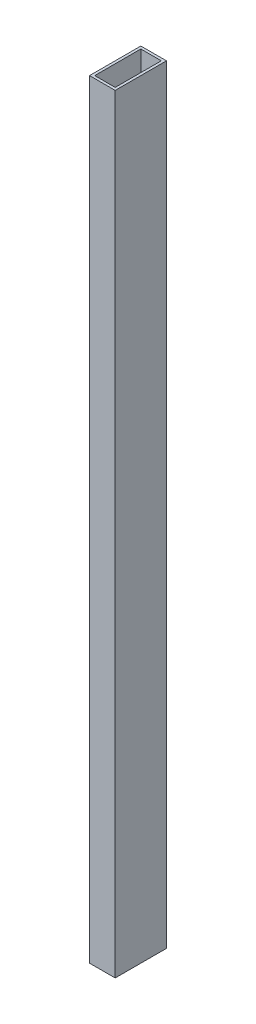
ISO-10303-21;
HEADER;
FILE_DESCRIPTION(('STEP AP214'),'2;1');
FILE_NAME('part.step','',(''),(''),'','','');
FILE_SCHEMA(('AUTOMOTIVE_DESIGN { 1 0 10303 214 1 1 1 1 }'));
ENDSEC;
DATA;
#1=APPLICATION_CONTEXT('core data for automotive mechanical design processes');
#2=APPLICATION_PROTOCOL_DEFINITION('international standard','automotive_design',2000,#1);
#3=PRODUCT_CONTEXT('',#1,'mechanical');
#4=PRODUCT('Part','Part','',(#3));
#5=PRODUCT_RELATED_PRODUCT_CATEGORY('part','',(#4));
#6=PRODUCT_DEFINITION_FORMATION('','',#4);
#7=PRODUCT_DEFINITION_CONTEXT('part definition',#1,'design');
#8=PRODUCT_DEFINITION('design','',#6,#7);
#9=PRODUCT_DEFINITION_SHAPE('','',#8);
#10=(LENGTH_UNIT() NAMED_UNIT(*) SI_UNIT(.MILLI.,.METRE.));
#11=(NAMED_UNIT(*) PLANE_ANGLE_UNIT() SI_UNIT($,.RADIAN.));
#12=(NAMED_UNIT(*) SI_UNIT($,.STERADIAN.) SOLID_ANGLE_UNIT());
#13=UNCERTAINTY_MEASURE_WITH_UNIT(LENGTH_MEASURE(1.E-05),#10,'distance_accuracy_value','');
#14=(GEOMETRIC_REPRESENTATION_CONTEXT(3) GLOBAL_UNCERTAINTY_ASSIGNED_CONTEXT((#13)) GLOBAL_UNIT_ASSIGNED_CONTEXT((#10,
#11,#12)) REPRESENTATION_CONTEXT('',''));
#15=CARTESIAN_POINT('',(0.,0.,0.));
#16=DIRECTION('',(0.,0.,1.));
#17=DIRECTION('',(1.,0.,0.));
#18=AXIS2_PLACEMENT_3D('',#15,#16,#17);
#19=CARTESIAN_POINT('',(0.,300.,0.));
#20=DIRECTION('',(0.,1.,0.));
#21=DIRECTION('',(0.,0.,1.));
#22=AXIS2_PLACEMENT_3D('',#19,#20,#21);
#23=PLANE('',#22);
#24=DIRECTION('',(0.,0.,1.));
#25=VECTOR('',#24,1.);
#26=CARTESIAN_POINT('',(-5.,300.,10.));
#27=LINE('',#26,#25);
#28=CARTESIAN_POINT('',(-5.,300.,-9.99999999999999));
#29=VERTEX_POINT('',#28);
#30=CARTESIAN_POINT('',(-5.,300.,10.));
#31=VERTEX_POINT('',#30);
#32=EDGE_CURVE('E138',#29,#31,#27,.T.);
#33=ORIENTED_EDGE('',*,*,#32,.T.);
#34=DIRECTION('',(1.,0.,0.));
#35=VECTOR('',#34,1.);
#36=CARTESIAN_POINT('',(5.,300.,10.));
#37=LINE('',#36,#35);
#38=CARTESIAN_POINT('',(5.,300.,10.));
#39=VERTEX_POINT('',#38);
#40=EDGE_CURVE('E141',#31,#39,#37,.T.);
#41=ORIENTED_EDGE('',*,*,#40,.T.);
#42=DIRECTION('',(0.,0.,-1.));
#43=VECTOR('',#42,1.);
#44=CARTESIAN_POINT('',(5.,300.,10.));
#45=LINE('',#44,#43);
#46=CARTESIAN_POINT('',(5.,300.,-10.));
#47=VERTEX_POINT('',#46);
#48=EDGE_CURVE('E144',#39,#47,#45,.T.);
#49=ORIENTED_EDGE('',*,*,#48,.T.);
#50=DIRECTION('',(-1.,0.,0.));
#51=VECTOR('',#50,1.);
#52=CARTESIAN_POINT('',(5.,300.,-10.));
#53=LINE('',#52,#51);
#54=EDGE_CURVE('E146',#47,#29,#53,.T.);
#55=ORIENTED_EDGE('',*,*,#54,.T.);
#56=EDGE_LOOP('',(#33,#41,#49,#55));
#57=FACE_BOUND('',#56,.T.);
#58=DIRECTION('',(1.,0.,0.));
#59=VECTOR('',#58,1.);
#60=CARTESIAN_POINT('',(4.,300.,9.));
#61=LINE('',#60,#59);
#62=CARTESIAN_POINT('',(-4.,300.,9.));
#63=VERTEX_POINT('',#62);
#64=CARTESIAN_POINT('',(4.,300.,9.));
#65=VERTEX_POINT('',#64);
#66=EDGE_CURVE('E110',#63,#65,#61,.T.);
#67=ORIENTED_EDGE('',*,*,#66,.F.);
#68=DIRECTION('',(0.,0.,1.));
#69=VECTOR('',#68,1.);
#70=CARTESIAN_POINT('',(-4.,300.,9.));
#71=LINE('',#70,#69);
#72=CARTESIAN_POINT('',(-4.,300.,-9.));
#73=VERTEX_POINT('',#72);
#74=EDGE_CURVE('E102',#73,#63,#71,.T.);
#75=ORIENTED_EDGE('',*,*,#74,.F.);
#76=DIRECTION('',(-1.,0.,0.));
#77=VECTOR('',#76,1.);
#78=CARTESIAN_POINT('',(4.,300.,-9.));
#79=LINE('',#78,#77);
#80=CARTESIAN_POINT('',(4.,300.,-9.));
#81=VERTEX_POINT('',#80);
#82=EDGE_CURVE('E124',#81,#73,#79,.T.);
#83=ORIENTED_EDGE('',*,*,#82,.F.);
#84=DIRECTION('',(0.,0.,-1.));
#85=VECTOR('',#84,1.);
#86=CARTESIAN_POINT('',(4.,300.,9.));
#87=LINE('',#86,#85);
#88=EDGE_CURVE('E122',#65,#81,#87,.T.);
#89=ORIENTED_EDGE('',*,*,#88,.F.);
#90=EDGE_LOOP('',(#67,#75,#83,#89));
#91=FACE_BOUND('',#90,.T.);
#92=ADVANCED_FACE('F37',(#57,#91),#23,.T.);
#93=CARTESIAN_POINT('',(0.,0.,0.));
#94=DIRECTION('',(0.,1.,0.));
#95=DIRECTION('',(0.,0.,1.));
#96=AXIS2_PLACEMENT_3D('',#93,#94,#95);
#97=PLANE('',#96);
#98=DIRECTION('',(0.,0.,1.));
#99=VECTOR('',#98,1.);
#100=CARTESIAN_POINT('',(-5.,0.,10.));
#101=LINE('',#100,#99);
#102=CARTESIAN_POINT('',(-5.,0.,-9.99999999999999));
#103=VERTEX_POINT('',#102);
#104=CARTESIAN_POINT('',(-5.,0.,10.));
#105=VERTEX_POINT('',#104);
#106=EDGE_CURVE('E118',#103,#105,#101,.T.);
#107=ORIENTED_EDGE('',*,*,#106,.F.);
#108=DIRECTION('',(-1.,0.,0.));
#109=VECTOR('',#108,1.);
#110=CARTESIAN_POINT('',(5.,0.,-10.));
#111=LINE('',#110,#109);
#112=CARTESIAN_POINT('',(5.,0.,-10.));
#113=VERTEX_POINT('',#112);
#114=EDGE_CURVE('E142',#113,#103,#111,.T.);
#115=ORIENTED_EDGE('',*,*,#114,.F.);
#116=DIRECTION('',(0.,0.,-1.));
#117=VECTOR('',#116,1.);
#118=CARTESIAN_POINT('',(5.,0.,10.));
#119=LINE('',#118,#117);
#120=CARTESIAN_POINT('',(5.,0.,10.));
#121=VERTEX_POINT('',#120);
#122=EDGE_CURVE('E153',#121,#113,#119,.T.);
#123=ORIENTED_EDGE('',*,*,#122,.F.);
#124=DIRECTION('',(1.,0.,0.));
#125=VECTOR('',#124,1.);
#126=CARTESIAN_POINT('',(5.,0.,10.));
#127=LINE('',#126,#125);
#128=EDGE_CURVE('E151',#105,#121,#127,.T.);
#129=ORIENTED_EDGE('',*,*,#128,.F.);
#130=EDGE_LOOP('',(#107,#115,#123,#129));
#131=FACE_BOUND('',#130,.T.);
#132=DIRECTION('',(0.,0.,1.));
#133=VECTOR('',#132,1.);
#134=CARTESIAN_POINT('',(-4.,0.,9.));
#135=LINE('',#134,#133);
#136=CARTESIAN_POINT('',(-4.,0.,-9.));
#137=VERTEX_POINT('',#136);
#138=CARTESIAN_POINT('',(-4.,0.,9.));
#139=VERTEX_POINT('',#138);
#140=EDGE_CURVE('E60',#137,#139,#135,.T.);
#141=ORIENTED_EDGE('',*,*,#140,.T.);
#142=DIRECTION('',(1.,0.,0.));
#143=VECTOR('',#142,1.);
#144=CARTESIAN_POINT('',(4.,0.,9.));
#145=LINE('',#144,#143);
#146=CARTESIAN_POINT('',(4.,0.,9.));
#147=VERTEX_POINT('',#146);
#148=EDGE_CURVE('E117',#139,#147,#145,.T.);
#149=ORIENTED_EDGE('',*,*,#148,.T.);
#150=DIRECTION('',(0.,0.,-1.));
#151=VECTOR('',#150,1.);
#152=CARTESIAN_POINT('',(4.,0.,9.));
#153=LINE('',#152,#151);
#154=CARTESIAN_POINT('',(4.,0.,-9.));
#155=VERTEX_POINT('',#154);
#156=EDGE_CURVE('E130',#147,#155,#153,.T.);
#157=ORIENTED_EDGE('',*,*,#156,.T.);
#158=DIRECTION('',(-1.,0.,0.));
#159=VECTOR('',#158,1.);
#160=CARTESIAN_POINT('',(4.,0.,-9.));
#161=LINE('',#160,#159);
#162=EDGE_CURVE('E111',#155,#137,#161,.T.);
#163=ORIENTED_EDGE('',*,*,#162,.T.);
#164=EDGE_LOOP('',(#141,#149,#157,#163));
#165=FACE_BOUND('',#164,.T.);
#166=ADVANCED_FACE('F171',(#131,#165),#97,.F.);
#167=CARTESIAN_POINT('',(-5.,300.,10.));
#168=DIRECTION('',(1.,0.,0.));
#169=DIRECTION('',(0.,0.,-1.));
#170=AXIS2_PLACEMENT_3D('',#167,#168,#169);
#171=PLANE('',#170);
#172=ORIENTED_EDGE('',*,*,#106,.T.);
#173=DIRECTION('',(0.,-1.,0.));
#174=VECTOR('',#173,1.);
#175=CARTESIAN_POINT('',(-5.,300.,10.));
#176=LINE('',#175,#174);
#177=EDGE_CURVE('E11',#31,#105,#176,.T.);
#178=ORIENTED_EDGE('',*,*,#177,.F.);
#179=ORIENTED_EDGE('',*,*,#32,.F.);
#180=DIRECTION('',(0.,-1.,0.));
#181=VECTOR('',#180,1.);
#182=CARTESIAN_POINT('',(-5.,300.,-9.99999999999999));
#183=LINE('',#182,#181);
#184=EDGE_CURVE('E148',#29,#103,#183,.T.);
#185=ORIENTED_EDGE('',*,*,#184,.T.);
#186=EDGE_LOOP('',(#172,#178,#179,#185));
#187=FACE_BOUND('',#186,.T.);
#188=ADVANCED_FACE('F39',(#187),#171,.F.);
#189=CARTESIAN_POINT('',(5.,300.,10.));
#190=DIRECTION('',(0.,0.,-1.));
#191=DIRECTION('',(-1.,0.,0.));
#192=AXIS2_PLACEMENT_3D('',#189,#190,#191);
#193=PLANE('',#192);
#194=ORIENTED_EDGE('',*,*,#128,.T.);
#195=DIRECTION('',(0.,-1.,0.));
#196=VECTOR('',#195,1.);
#197=CARTESIAN_POINT('',(5.,300.,10.));
#198=LINE('',#197,#196);
#199=EDGE_CURVE('E45',#39,#121,#198,.T.);
#200=ORIENTED_EDGE('',*,*,#199,.F.);
#201=ORIENTED_EDGE('',*,*,#40,.F.);
#202=ORIENTED_EDGE('',*,*,#177,.T.);
#203=EDGE_LOOP('',(#194,#200,#201,#202));
#204=FACE_BOUND('',#203,.T.);
#205=ADVANCED_FACE('F181',(#204),#193,.F.);
#206=CARTESIAN_POINT('',(5.,300.,10.));
#207=DIRECTION('',(-1.,0.,0.));
#208=DIRECTION('',(0.,0.,1.));
#209=AXIS2_PLACEMENT_3D('',#206,#207,#208);
#210=PLANE('',#209);
#211=ORIENTED_EDGE('',*,*,#122,.T.);
#212=DIRECTION('',(0.,-1.,0.));
#213=VECTOR('',#212,1.);
#214=CARTESIAN_POINT('',(5.,300.,-10.));
#215=LINE('',#214,#213);
#216=EDGE_CURVE('E158',#47,#113,#215,.T.);
#217=ORIENTED_EDGE('',*,*,#216,.F.);
#218=ORIENTED_EDGE('',*,*,#48,.F.);
#219=ORIENTED_EDGE('',*,*,#199,.T.);
#220=EDGE_LOOP('',(#211,#217,#218,#219));
#221=FACE_BOUND('',#220,.T.);
#222=ADVANCED_FACE('F165',(#221),#210,.F.);
#223=CARTESIAN_POINT('',(5.,300.,-10.));
#224=DIRECTION('',(0.,0.,1.));
#225=DIRECTION('',(1.,0.,0.));
#226=AXIS2_PLACEMENT_3D('',#223,#224,#225);
#227=PLANE('',#226);
#228=ORIENTED_EDGE('',*,*,#114,.T.);
#229=ORIENTED_EDGE('',*,*,#184,.F.);
#230=ORIENTED_EDGE('',*,*,#54,.F.);
#231=ORIENTED_EDGE('',*,*,#216,.T.);
#232=EDGE_LOOP('',(#228,#229,#230,#231));
#233=FACE_BOUND('',#232,.T.);
#234=ADVANCED_FACE('F175',(#233),#227,.F.);
#235=CARTESIAN_POINT('',(-4.,300.,9.));
#236=DIRECTION('',(1.,0.,0.));
#237=DIRECTION('',(0.,0.,-1.));
#238=AXIS2_PLACEMENT_3D('',#235,#236,#237);
#239=PLANE('',#238);
#240=ORIENTED_EDGE('',*,*,#140,.F.);
#241=DIRECTION('',(0.,-1.,0.));
#242=VECTOR('',#241,1.);
#243=CARTESIAN_POINT('',(-4.,300.,-9.));
#244=LINE('',#243,#242);
#245=EDGE_CURVE('E106',#73,#137,#244,.T.);
#246=ORIENTED_EDGE('',*,*,#245,.F.);
#247=ORIENTED_EDGE('',*,*,#74,.T.);
#248=DIRECTION('',(0.,-1.,0.));
#249=VECTOR('',#248,1.);
#250=CARTESIAN_POINT('',(-4.,300.,9.));
#251=LINE('',#250,#249);
#252=EDGE_CURVE('E105',#63,#139,#251,.T.);
#253=ORIENTED_EDGE('',*,*,#252,.T.);
#254=EDGE_LOOP('',(#240,#246,#247,#253));
#255=FACE_BOUND('',#254,.T.);
#256=ADVANCED_FACE('F104',(#255),#239,.T.);
#257=CARTESIAN_POINT('',(4.,300.,9.));
#258=DIRECTION('',(0.,0.,-1.));
#259=DIRECTION('',(-1.,0.,0.));
#260=AXIS2_PLACEMENT_3D('',#257,#258,#259);
#261=PLANE('',#260);
#262=ORIENTED_EDGE('',*,*,#148,.F.);
#263=ORIENTED_EDGE('',*,*,#252,.F.);
#264=ORIENTED_EDGE('',*,*,#66,.T.);
#265=DIRECTION('',(0.,-1.,0.));
#266=VECTOR('',#265,1.);
#267=CARTESIAN_POINT('',(4.,300.,9.));
#268=LINE('',#267,#266);
#269=EDGE_CURVE('E119',#65,#147,#268,.T.);
#270=ORIENTED_EDGE('',*,*,#269,.T.);
#271=EDGE_LOOP('',(#262,#263,#264,#270));
#272=FACE_BOUND('',#271,.T.);
#273=ADVANCED_FACE('F114',(#272),#261,.T.);
#274=CARTESIAN_POINT('',(4.,300.,9.));
#275=DIRECTION('',(-1.,0.,0.));
#276=DIRECTION('',(0.,0.,1.));
#277=AXIS2_PLACEMENT_3D('',#274,#275,#276);
#278=PLANE('',#277);
#279=ORIENTED_EDGE('',*,*,#156,.F.);
#280=ORIENTED_EDGE('',*,*,#269,.F.);
#281=ORIENTED_EDGE('',*,*,#88,.T.);
#282=DIRECTION('',(0.,-1.,0.));
#283=VECTOR('',#282,1.);
#284=CARTESIAN_POINT('',(4.,300.,-9.));
#285=LINE('',#284,#283);
#286=EDGE_CURVE('E52',#81,#155,#285,.T.);
#287=ORIENTED_EDGE('',*,*,#286,.T.);
#288=EDGE_LOOP('',(#279,#280,#281,#287));
#289=FACE_BOUND('',#288,.T.);
#290=ADVANCED_FACE('F204',(#289),#278,.T.);
#291=CARTESIAN_POINT('',(4.,300.,-9.));
#292=DIRECTION('',(0.,0.,1.));
#293=DIRECTION('',(1.,0.,0.));
#294=AXIS2_PLACEMENT_3D('',#291,#292,#293);
#295=PLANE('',#294);
#296=ORIENTED_EDGE('',*,*,#162,.F.);
#297=ORIENTED_EDGE('',*,*,#286,.F.);
#298=ORIENTED_EDGE('',*,*,#82,.T.);
#299=ORIENTED_EDGE('',*,*,#245,.T.);
#300=EDGE_LOOP('',(#296,#297,#298,#299));
#301=FACE_BOUND('',#300,.T.);
#302=ADVANCED_FACE('F208',(#301),#295,.T.);
#303=CLOSED_SHELL('',(#92,#166,#188,#205,#222,#234,#256,#273,#290,#302));
#304=MANIFOLD_SOLID_BREP('B2',#303);
#305=ADVANCED_BREP_SHAPE_REPRESENTATION('',(#18,#304),#14);
#306=SHAPE_DEFINITION_REPRESENTATION(#9,#305);
ENDSEC;
END-ISO-10303-21;
